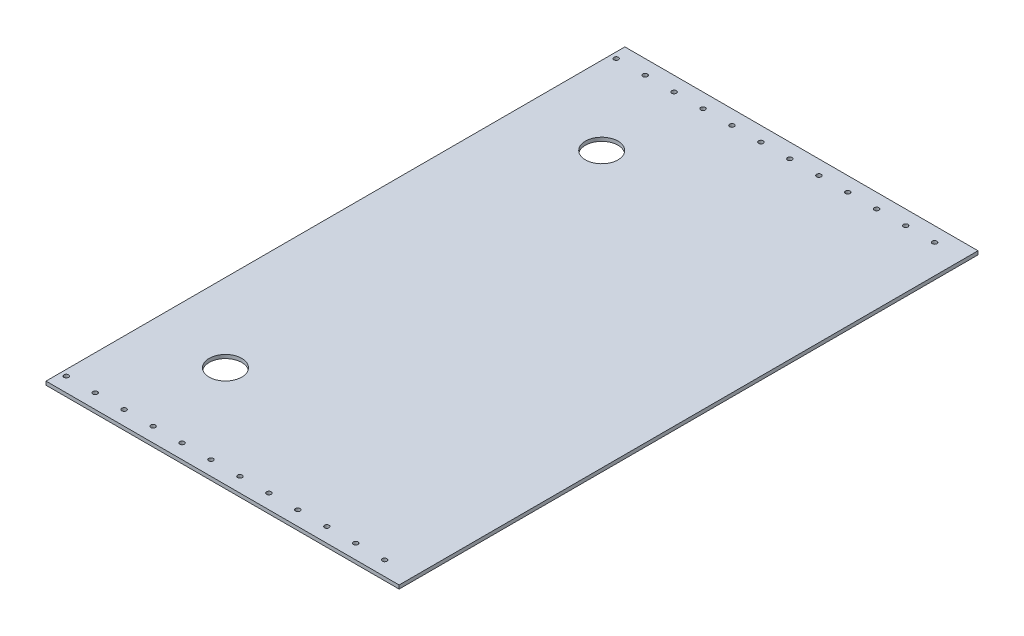
ISO-10303-21;
HEADER;
FILE_DESCRIPTION(('STEP AP214'),'2;1');
FILE_NAME('part.step','',(''),(''),'','','');
FILE_SCHEMA(('AUTOMOTIVE_DESIGN { 1 0 10303 214 1 1 1 1 }'));
ENDSEC;
DATA;
#1=APPLICATION_CONTEXT('core data for automotive mechanical design processes');
#2=APPLICATION_PROTOCOL_DEFINITION('international standard','automotive_design',2000,#1);
#3=PRODUCT_CONTEXT('',#1,'mechanical');
#4=PRODUCT('Part','Part','',(#3));
#5=PRODUCT_RELATED_PRODUCT_CATEGORY('part','',(#4));
#6=PRODUCT_DEFINITION_FORMATION('','',#4);
#7=PRODUCT_DEFINITION_CONTEXT('part definition',#1,'design');
#8=PRODUCT_DEFINITION('design','',#6,#7);
#9=PRODUCT_DEFINITION_SHAPE('','',#8);
#10=(LENGTH_UNIT() NAMED_UNIT(*) SI_UNIT(.MILLI.,.METRE.));
#11=(NAMED_UNIT(*) PLANE_ANGLE_UNIT() SI_UNIT($,.RADIAN.));
#12=(NAMED_UNIT(*) SI_UNIT($,.STERADIAN.) SOLID_ANGLE_UNIT());
#13=UNCERTAINTY_MEASURE_WITH_UNIT(LENGTH_MEASURE(1.E-05),#10,'distance_accuracy_value','');
#14=(GEOMETRIC_REPRESENTATION_CONTEXT(3) GLOBAL_UNCERTAINTY_ASSIGNED_CONTEXT((#13)) GLOBAL_UNIT_ASSIGNED_CONTEXT((#10,
#11,#12)) REPRESENTATION_CONTEXT('',''));
#15=CARTESIAN_POINT('',(0.,0.,0.));
#16=DIRECTION('',(0.,0.,1.));
#17=DIRECTION('',(1.,0.,0.));
#18=AXIS2_PLACEMENT_3D('',#15,#16,#17);
#19=CARTESIAN_POINT('',(0.,3.175,0.));
#20=DIRECTION('',(0.,0.,-1.));
#21=DIRECTION('',(-1.,0.,0.));
#22=AXIS2_PLACEMENT_3D('',#19,#20,#21);
#23=PLANE('',#22);
#24=DIRECTION('',(0.,1.,0.));
#25=VECTOR('',#24,1.);
#26=CARTESIAN_POINT('',(261.62,3.175,0.));
#27=LINE('',#26,#25);
#28=CARTESIAN_POINT('',(261.62,0.,0.));
#29=VERTEX_POINT('',#28);
#30=CARTESIAN_POINT('',(261.62,3.175,0.));
#31=VERTEX_POINT('',#30);
#32=EDGE_CURVE('E317',#29,#31,#27,.T.);
#33=ORIENTED_EDGE('',*,*,#32,.F.);
#34=DIRECTION('',(1.,0.,0.));
#35=VECTOR('',#34,1.);
#36=CARTESIAN_POINT('',(0.,0.,0.));
#37=LINE('',#36,#35);
#38=CARTESIAN_POINT('',(571.5,0.,0.));
#39=VERTEX_POINT('',#38);
#40=EDGE_CURVE('E85',#29,#39,#37,.T.);
#41=ORIENTED_EDGE('',*,*,#40,.T.);
#42=DIRECTION('',(0.,-1.,0.));
#43=VECTOR('',#42,1.);
#44=CARTESIAN_POINT('',(571.5,3.175,0.));
#45=LINE('',#44,#43);
#46=CARTESIAN_POINT('',(571.5,3.175,0.));
#47=VERTEX_POINT('',#46);
#48=EDGE_CURVE('E11',#47,#39,#45,.T.);
#49=ORIENTED_EDGE('',*,*,#48,.F.);
#50=DIRECTION('',(1.,0.,0.));
#51=VECTOR('',#50,1.);
#52=CARTESIAN_POINT('',(0.,3.175,0.));
#53=LINE('',#52,#51);
#54=EDGE_CURVE('E95',#31,#47,#53,.T.);
#55=ORIENTED_EDGE('',*,*,#54,.F.);
#56=EDGE_LOOP('',(#33,#41,#49,#55));
#57=FACE_BOUND('',#56,.T.);
#58=ADVANCED_FACE('F39',(#57),#23,.F.);
#59=CARTESIAN_POINT('',(0.,3.175,-508.));
#60=DIRECTION('',(0.,0.,1.));
#61=DIRECTION('',(1.,0.,0.));
#62=AXIS2_PLACEMENT_3D('',#59,#60,#61);
#63=PLANE('',#62);
#64=DIRECTION('',(0.,-1.,0.));
#65=VECTOR('',#64,1.);
#66=CARTESIAN_POINT('',(261.62,3.175,-508.));
#67=LINE('',#66,#65);
#68=CARTESIAN_POINT('',(261.62,3.175,-508.));
#69=VERTEX_POINT('',#68);
#70=CARTESIAN_POINT('',(261.62,0.,-508.));
#71=VERTEX_POINT('',#70);
#72=EDGE_CURVE('E54',#69,#71,#67,.T.);
#73=ORIENTED_EDGE('',*,*,#72,.F.);
#74=DIRECTION('',(-1.,0.,0.));
#75=VECTOR('',#74,1.);
#76=CARTESIAN_POINT('',(0.,3.175,-508.));
#77=LINE('',#76,#75);
#78=CARTESIAN_POINT('',(571.5,3.175,-508.));
#79=VERTEX_POINT('',#78);
#80=EDGE_CURVE('E90',#79,#69,#77,.T.);
#81=ORIENTED_EDGE('',*,*,#80,.F.);
#82=DIRECTION('',(0.,-1.,0.));
#83=VECTOR('',#82,1.);
#84=CARTESIAN_POINT('',(571.5,3.175,-508.));
#85=LINE('',#84,#83);
#86=CARTESIAN_POINT('',(571.5,0.,-508.));
#87=VERTEX_POINT('',#86);
#88=EDGE_CURVE('E47',#79,#87,#85,.T.);
#89=ORIENTED_EDGE('',*,*,#88,.T.);
#90=DIRECTION('',(-1.,0.,0.));
#91=VECTOR('',#90,1.);
#92=CARTESIAN_POINT('',(0.,0.,-508.));
#93=LINE('',#92,#91);
#94=EDGE_CURVE('E84',#87,#71,#93,.T.);
#95=ORIENTED_EDGE('',*,*,#94,.T.);
#96=EDGE_LOOP('',(#73,#81,#89,#95));
#97=FACE_BOUND('',#96,.T.);
#98=ADVANCED_FACE('F89',(#97),#63,.F.);
#99=CARTESIAN_POINT('',(0.,3.175,0.));
#100=DIRECTION('',(0.,-1.,0.));
#101=DIRECTION('',(0.,0.,-1.));
#102=AXIS2_PLACEMENT_3D('',#99,#100,#101);
#103=PLANE('',#102);
#104=CARTESIAN_POINT('',(342.9,3.175,-495.3));
#105=DIRECTION('',(0.,1.,0.));
#106=DIRECTION('',(0.,0.,1.));
#107=AXIS2_PLACEMENT_3D('',#104,#105,#106);
#108=CIRCLE('',#107,2.01929999999992);
#109=CARTESIAN_POINT('',(342.9,3.175,-493.2807));
#110=VERTEX_POINT('',#109);
#111=EDGE_CURVE('E212',#110,#110,#108,.T.);
#112=ORIENTED_EDGE('',*,*,#111,.F.);
#113=EDGE_LOOP('',(#112));
#114=FACE_BOUND('',#113,.T.);
#115=CARTESIAN_POINT('',(317.5,3.175,-495.3));
#116=DIRECTION('',(0.,1.,0.));
#117=DIRECTION('',(0.,0.,1.));
#118=AXIS2_PLACEMENT_3D('',#115,#116,#117);
#119=CIRCLE('',#118,2.01929999999992);
#120=CARTESIAN_POINT('',(317.5,3.175,-493.2807));
#121=VERTEX_POINT('',#120);
#122=EDGE_CURVE('E204',#121,#121,#119,.T.);
#123=ORIENTED_EDGE('',*,*,#122,.F.);
#124=EDGE_LOOP('',(#123));
#125=FACE_BOUND('',#124,.T.);
#126=CARTESIAN_POINT('',(292.1,3.175,-495.3));
#127=DIRECTION('',(0.,1.,0.));
#128=DIRECTION('',(0.,0.,1.));
#129=AXIS2_PLACEMENT_3D('',#126,#127,#128);
#130=CIRCLE('',#129,2.01929999999992);
#131=CARTESIAN_POINT('',(292.1,3.175,-493.2807));
#132=VERTEX_POINT('',#131);
#133=EDGE_CURVE('E196',#132,#132,#130,.T.);
#134=ORIENTED_EDGE('',*,*,#133,.F.);
#135=EDGE_LOOP('',(#134));
#136=FACE_BOUND('',#135,.T.);
#137=CARTESIAN_POINT('',(266.7,3.175,-495.3));
#138=DIRECTION('',(0.,1.,0.));
#139=DIRECTION('',(0.,0.,1.));
#140=AXIS2_PLACEMENT_3D('',#137,#138,#139);
#141=CIRCLE('',#140,2.01929999999992);
#142=CARTESIAN_POINT('',(266.7,3.175,-493.2807));
#143=VERTEX_POINT('',#142);
#144=EDGE_CURVE('E187',#143,#143,#141,.T.);
#145=ORIENTED_EDGE('',*,*,#144,.F.);
#146=EDGE_LOOP('',(#145));
#147=FACE_BOUND('',#146,.T.);
#148=CARTESIAN_POINT('',(266.7,3.175,-12.7));
#149=DIRECTION('',(0.,1.,0.));
#150=DIRECTION('',(0.,0.,-1.));
#151=AXIS2_PLACEMENT_3D('',#148,#149,#150);
#152=CIRCLE('',#151,2.01929999999992);
#153=CARTESIAN_POINT('',(266.7,3.175,-14.7192999999999));
#154=VERTEX_POINT('',#153);
#155=EDGE_CURVE('E219',#154,#154,#152,.T.);
#156=ORIENTED_EDGE('',*,*,#155,.F.);
#157=EDGE_LOOP('',(#156));
#158=FACE_BOUND('',#157,.T.);
#159=CARTESIAN_POINT('',(469.9,3.175,-495.3));
#160=DIRECTION('',(0.,1.,0.));
#161=DIRECTION('',(0.,0.,1.));
#162=AXIS2_PLACEMENT_3D('',#159,#160,#161);
#163=CIRCLE('',#162,2.01929999999992);
#164=CARTESIAN_POINT('',(469.9,3.175,-493.2807));
#165=VERTEX_POINT('',#164);
#166=EDGE_CURVE('E139',#165,#165,#163,.T.);
#167=ORIENTED_EDGE('',*,*,#166,.F.);
#168=EDGE_LOOP('',(#167));
#169=FACE_BOUND('',#168,.T.);
#170=CARTESIAN_POINT('',(495.3,3.175,-495.3));
#171=DIRECTION('',(0.,1.,0.));
#172=DIRECTION('',(0.,0.,1.));
#173=AXIS2_PLACEMENT_3D('',#170,#171,#172);
#174=CIRCLE('',#173,2.01929999999992);
#175=CARTESIAN_POINT('',(495.3,3.175,-493.2807));
#176=VERTEX_POINT('',#175);
#177=EDGE_CURVE('E148',#176,#176,#174,.T.);
#178=ORIENTED_EDGE('',*,*,#177,.F.);
#179=EDGE_LOOP('',(#178));
#180=FACE_BOUND('',#179,.T.);
#181=CARTESIAN_POINT('',(520.7,3.175,-495.3));
#182=DIRECTION('',(0.,1.,0.));
#183=DIRECTION('',(0.,0.,1.));
#184=AXIS2_PLACEMENT_3D('',#181,#182,#183);
#185=CIRCLE('',#184,2.01929999999992);
#186=CARTESIAN_POINT('',(520.7,3.175,-493.2807));
#187=VERTEX_POINT('',#186);
#188=EDGE_CURVE('E131',#187,#187,#185,.T.);
#189=ORIENTED_EDGE('',*,*,#188,.F.);
#190=EDGE_LOOP('',(#189));
#191=FACE_BOUND('',#190,.T.);
#192=CARTESIAN_POINT('',(444.5,3.175,-495.3));
#193=DIRECTION('',(0.,1.,0.));
#194=DIRECTION('',(0.,0.,1.));
#195=AXIS2_PLACEMENT_3D('',#192,#193,#194);
#196=CIRCLE('',#195,2.01929999999992);
#197=CARTESIAN_POINT('',(444.5,3.175,-493.2807));
#198=VERTEX_POINT('',#197);
#199=EDGE_CURVE('E180',#198,#198,#196,.T.);
#200=ORIENTED_EDGE('',*,*,#199,.F.);
#201=EDGE_LOOP('',(#200));
#202=FACE_BOUND('',#201,.T.);
#203=CARTESIAN_POINT('',(419.1,3.175,-495.3));
#204=DIRECTION('',(0.,1.,0.));
#205=DIRECTION('',(0.,0.,1.));
#206=AXIS2_PLACEMENT_3D('',#203,#204,#205);
#207=CIRCLE('',#206,2.01929999999992);
#208=CARTESIAN_POINT('',(419.1,3.175,-493.2807));
#209=VERTEX_POINT('',#208);
#210=EDGE_CURVE('E172',#209,#209,#207,.T.);
#211=ORIENTED_EDGE('',*,*,#210,.F.);
#212=EDGE_LOOP('',(#211));
#213=FACE_BOUND('',#212,.T.);
#214=CARTESIAN_POINT('',(393.7,3.175,-495.3));
#215=DIRECTION('',(0.,1.,0.));
#216=DIRECTION('',(0.,0.,1.));
#217=AXIS2_PLACEMENT_3D('',#214,#215,#216);
#218=CIRCLE('',#217,2.01929999999992);
#219=CARTESIAN_POINT('',(393.7,3.175,-493.2807));
#220=VERTEX_POINT('',#219);
#221=EDGE_CURVE('E164',#220,#220,#218,.T.);
#222=ORIENTED_EDGE('',*,*,#221,.F.);
#223=EDGE_LOOP('',(#222));
#224=FACE_BOUND('',#223,.T.);
#225=CARTESIAN_POINT('',(368.3,3.175,-495.3));
#226=DIRECTION('',(0.,1.,0.));
#227=DIRECTION('',(0.,0.,1.));
#228=AXIS2_PLACEMENT_3D('',#225,#226,#227);
#229=CIRCLE('',#228,2.01929999999992);
#230=CARTESIAN_POINT('',(368.3,3.175,-493.2807));
#231=VERTEX_POINT('',#230);
#232=EDGE_CURVE('E155',#231,#231,#229,.T.);
#233=ORIENTED_EDGE('',*,*,#232,.F.);
#234=EDGE_LOOP('',(#233));
#235=FACE_BOUND('',#234,.T.);
#236=CARTESIAN_POINT('',(292.1,3.175,-12.7));
#237=DIRECTION('',(0.,1.,0.));
#238=DIRECTION('',(0.,0.,-1.));
#239=AXIS2_PLACEMENT_3D('',#236,#237,#238);
#240=CIRCLE('',#239,2.01929999999992);
#241=CARTESIAN_POINT('',(292.1,3.175,-14.7192999999999));
#242=VERTEX_POINT('',#241);
#243=EDGE_CURVE('E308',#242,#242,#240,.T.);
#244=ORIENTED_EDGE('',*,*,#243,.F.);
#245=EDGE_LOOP('',(#244));
#246=FACE_BOUND('',#245,.T.);
#247=CARTESIAN_POINT('',(317.5,3.175,-12.7));
#248=DIRECTION('',(0.,1.,0.));
#249=DIRECTION('',(0.,0.,-1.));
#250=AXIS2_PLACEMENT_3D('',#247,#248,#249);
#251=CIRCLE('',#250,2.01929999999992);
#252=CARTESIAN_POINT('',(317.5,3.175,-14.7192999999999));
#253=VERTEX_POINT('',#252);
#254=EDGE_CURVE('E300',#253,#253,#251,.T.);
#255=ORIENTED_EDGE('',*,*,#254,.F.);
#256=EDGE_LOOP('',(#255));
#257=FACE_BOUND('',#256,.T.);
#258=CARTESIAN_POINT('',(342.9,3.175,-12.7));
#259=DIRECTION('',(0.,1.,0.));
#260=DIRECTION('',(0.,0.,-1.));
#261=AXIS2_PLACEMENT_3D('',#258,#259,#260);
#262=CIRCLE('',#261,2.01929999999992);
#263=CARTESIAN_POINT('',(342.9,3.175,-14.7192999999999));
#264=VERTEX_POINT('',#263);
#265=EDGE_CURVE('E292',#264,#264,#262,.T.);
#266=ORIENTED_EDGE('',*,*,#265,.F.);
#267=EDGE_LOOP('',(#266));
#268=FACE_BOUND('',#267,.T.);
#269=CARTESIAN_POINT('',(368.3,3.175,-12.7));
#270=DIRECTION('',(0.,1.,0.));
#271=DIRECTION('',(0.,0.,-1.));
#272=AXIS2_PLACEMENT_3D('',#269,#270,#271);
#273=CIRCLE('',#272,2.01929999999992);
#274=CARTESIAN_POINT('',(368.3,3.175,-14.7192999999999));
#275=VERTEX_POINT('',#274);
#276=EDGE_CURVE('E284',#275,#275,#273,.T.);
#277=ORIENTED_EDGE('',*,*,#276,.F.);
#278=EDGE_LOOP('',(#277));
#279=FACE_BOUND('',#278,.T.);
#280=CARTESIAN_POINT('',(393.7,3.175,-12.7));
#281=DIRECTION('',(0.,1.,0.));
#282=DIRECTION('',(0.,0.,-1.));
#283=AXIS2_PLACEMENT_3D('',#280,#281,#282);
#284=CIRCLE('',#283,2.01929999999992);
#285=CARTESIAN_POINT('',(393.7,3.175,-14.7192999999999));
#286=VERTEX_POINT('',#285);
#287=EDGE_CURVE('E276',#286,#286,#284,.T.);
#288=ORIENTED_EDGE('',*,*,#287,.F.);
#289=EDGE_LOOP('',(#288));
#290=FACE_BOUND('',#289,.T.);
#291=CARTESIAN_POINT('',(419.1,3.175,-12.7));
#292=DIRECTION('',(0.,1.,0.));
#293=DIRECTION('',(0.,0.,-1.));
#294=AXIS2_PLACEMENT_3D('',#291,#292,#293);
#295=CIRCLE('',#294,2.01929999999992);
#296=CARTESIAN_POINT('',(419.1,3.175,-14.7192999999999));
#297=VERTEX_POINT('',#296);
#298=EDGE_CURVE('E268',#297,#297,#295,.T.);
#299=ORIENTED_EDGE('',*,*,#298,.F.);
#300=EDGE_LOOP('',(#299));
#301=FACE_BOUND('',#300,.T.);
#302=CARTESIAN_POINT('',(444.5,3.175,-12.7));
#303=DIRECTION('',(0.,1.,0.));
#304=DIRECTION('',(0.,0.,-1.));
#305=AXIS2_PLACEMENT_3D('',#302,#303,#304);
#306=CIRCLE('',#305,2.01929999999992);
#307=CARTESIAN_POINT('',(444.5,3.175,-14.7192999999999));
#308=VERTEX_POINT('',#307);
#309=EDGE_CURVE('E260',#308,#308,#306,.T.);
#310=ORIENTED_EDGE('',*,*,#309,.F.);
#311=EDGE_LOOP('',(#310));
#312=FACE_BOUND('',#311,.T.);
#313=CARTESIAN_POINT('',(469.9,3.175,-12.7));
#314=DIRECTION('',(0.,1.,0.));
#315=DIRECTION('',(0.,0.,-1.));
#316=AXIS2_PLACEMENT_3D('',#313,#314,#315);
#317=CIRCLE('',#316,2.01929999999992);
#318=CARTESIAN_POINT('',(469.9,3.175,-14.7192999999999));
#319=VERTEX_POINT('',#318);
#320=EDGE_CURVE('E252',#319,#319,#317,.T.);
#321=ORIENTED_EDGE('',*,*,#320,.F.);
#322=EDGE_LOOP('',(#321));
#323=FACE_BOUND('',#322,.T.);
#324=CARTESIAN_POINT('',(495.3,3.175,-12.7));
#325=DIRECTION('',(0.,1.,0.));
#326=DIRECTION('',(0.,0.,-1.));
#327=AXIS2_PLACEMENT_3D('',#324,#325,#326);
#328=CIRCLE('',#327,2.01929999999992);
#329=CARTESIAN_POINT('',(495.3,3.175,-14.7192999999999));
#330=VERTEX_POINT('',#329);
#331=EDGE_CURVE('E244',#330,#330,#328,.T.);
#332=ORIENTED_EDGE('',*,*,#331,.F.);
#333=EDGE_LOOP('',(#332));
#334=FACE_BOUND('',#333,.T.);
#335=CARTESIAN_POINT('',(520.7,3.175,-12.7));
#336=DIRECTION('',(0.,1.,0.));
#337=DIRECTION('',(0.,0.,-1.));
#338=AXIS2_PLACEMENT_3D('',#335,#336,#337);
#339=CIRCLE('',#338,2.01929999999992);
#340=CARTESIAN_POINT('',(520.7,3.175,-14.7192999999999));
#341=VERTEX_POINT('',#340);
#342=EDGE_CURVE('E236',#341,#341,#339,.T.);
#343=ORIENTED_EDGE('',*,*,#342,.F.);
#344=EDGE_LOOP('',(#343));
#345=FACE_BOUND('',#344,.T.);
#346=CARTESIAN_POINT('',(546.1,3.175,-12.7));
#347=DIRECTION('',(0.,1.,0.));
#348=DIRECTION('',(0.,0.,-1.));
#349=AXIS2_PLACEMENT_3D('',#346,#347,#348);
#350=CIRCLE('',#349,2.01929999999992);
#351=CARTESIAN_POINT('',(546.1,3.175,-14.7192999999999));
#352=VERTEX_POINT('',#351);
#353=EDGE_CURVE('E227',#352,#352,#350,.T.);
#354=ORIENTED_EDGE('',*,*,#353,.F.);
#355=EDGE_LOOP('',(#354));
#356=FACE_BOUND('',#355,.T.);
#357=CARTESIAN_POINT('',(546.1,3.175,-495.3));
#358=DIRECTION('',(0.,1.,0.));
#359=DIRECTION('',(0.,0.,1.));
#360=AXIS2_PLACEMENT_3D('',#357,#358,#359);
#361=CIRCLE('',#360,2.01929999999992);
#362=CARTESIAN_POINT('',(546.1,3.175,-493.2807));
#363=VERTEX_POINT('',#362);
#364=EDGE_CURVE('E123',#363,#363,#361,.T.);
#365=ORIENTED_EDGE('',*,*,#364,.F.);
#366=EDGE_LOOP('',(#365));
#367=FACE_BOUND('',#366,.T.);
#368=CARTESIAN_POINT('',(330.2,3.175,-419.1));
#369=DIRECTION('',(0.,1.,0.));
#370=DIRECTION('',(0.,0.,1.));
#371=AXIS2_PLACEMENT_3D('',#368,#369,#370);
#372=CIRCLE('',#371,14.2875);
#373=CARTESIAN_POINT('',(330.2,3.175,-404.8125));
#374=VERTEX_POINT('',#373);
#375=EDGE_CURVE('E116',#374,#374,#372,.T.);
#376=ORIENTED_EDGE('',*,*,#375,.F.);
#377=EDGE_LOOP('',(#376));
#378=FACE_BOUND('',#377,.T.);
#379=CARTESIAN_POINT('',(330.2,3.175,-88.9));
#380=DIRECTION('',(0.,1.,0.));
#381=DIRECTION('',(0.,0.,1.));
#382=AXIS2_PLACEMENT_3D('',#379,#380,#381);
#383=CIRCLE('',#382,14.2875);
#384=CARTESIAN_POINT('',(330.2,3.175,-74.6125));
#385=VERTEX_POINT('',#384);
#386=EDGE_CURVE('E107',#385,#385,#383,.T.);
#387=ORIENTED_EDGE('',*,*,#386,.F.);
#388=EDGE_LOOP('',(#387));
#389=FACE_BOUND('',#388,.T.);
#390=DIRECTION('',(0.,0.,-1.));
#391=VECTOR('',#390,1.);
#392=CARTESIAN_POINT('',(261.62,3.175,-508.));
#393=LINE('',#392,#391);
#394=EDGE_CURVE('E232',#31,#69,#393,.T.);
#395=ORIENTED_EDGE('',*,*,#394,.F.);
#396=ORIENTED_EDGE('',*,*,#54,.T.);
#397=DIRECTION('',(0.,0.,-1.));
#398=VECTOR('',#397,1.);
#399=CARTESIAN_POINT('',(571.5,3.175,0.));
#400=LINE('',#399,#398);
#401=EDGE_CURVE('E63',#47,#79,#400,.T.);
#402=ORIENTED_EDGE('',*,*,#401,.T.);
#403=ORIENTED_EDGE('',*,*,#80,.T.);
#404=EDGE_LOOP('',(#395,#396,#402,#403));
#405=FACE_BOUND('',#404,.T.);
#406=ADVANCED_FACE('F333',(#114,#125,#136,#147,#158,#169,#180,#191,#202,#213,#224,#235,#246,
#257,#268,#279,#290,#301,#312,#323,#334,#345,#356,#367,#378,#389,#405),#103,.F.);
#407=CARTESIAN_POINT('',(0.,0.,0.));
#408=DIRECTION('',(0.,-1.,0.));
#409=DIRECTION('',(0.,0.,-1.));
#410=AXIS2_PLACEMENT_3D('',#407,#408,#409);
#411=PLANE('',#410);
#412=CARTESIAN_POINT('',(330.2,0.,-88.9));
#413=DIRECTION('',(0.,1.,0.));
#414=DIRECTION('',(0.,0.,1.));
#415=AXIS2_PLACEMENT_3D('',#412,#413,#414);
#416=CIRCLE('',#415,14.2875);
#417=CARTESIAN_POINT('',(330.2,0.,-74.6125));
#418=VERTEX_POINT('',#417);
#419=EDGE_CURVE('E111',#418,#418,#416,.T.);
#420=ORIENTED_EDGE('',*,*,#419,.T.);
#421=EDGE_LOOP('',(#420));
#422=FACE_BOUND('',#421,.T.);
#423=CARTESIAN_POINT('',(330.2,0.,-419.1));
#424=DIRECTION('',(0.,1.,0.));
#425=DIRECTION('',(0.,0.,1.));
#426=AXIS2_PLACEMENT_3D('',#423,#424,#425);
#427=CIRCLE('',#426,14.2875);
#428=CARTESIAN_POINT('',(330.2,0.,-404.8125));
#429=VERTEX_POINT('',#428);
#430=EDGE_CURVE('E102',#429,#429,#427,.T.);
#431=ORIENTED_EDGE('',*,*,#430,.T.);
#432=EDGE_LOOP('',(#431));
#433=FACE_BOUND('',#432,.T.);
#434=CARTESIAN_POINT('',(546.1,0.,-495.3));
#435=DIRECTION('',(0.,1.,0.));
#436=DIRECTION('',(0.,0.,1.));
#437=AXIS2_PLACEMENT_3D('',#434,#435,#436);
#438=CIRCLE('',#437,2.01929999999992);
#439=CARTESIAN_POINT('',(546.1,0.,-493.2807));
#440=VERTEX_POINT('',#439);
#441=EDGE_CURVE('E112',#440,#440,#438,.T.);
#442=ORIENTED_EDGE('',*,*,#441,.T.);
#443=EDGE_LOOP('',(#442));
#444=FACE_BOUND('',#443,.T.);
#445=CARTESIAN_POINT('',(546.1,0.,-12.7));
#446=DIRECTION('',(0.,1.,0.));
#447=DIRECTION('',(0.,0.,-1.));
#448=AXIS2_PLACEMENT_3D('',#445,#446,#447);
#449=CIRCLE('',#448,2.01929999999992);
#450=CARTESIAN_POINT('',(546.1,0.,-14.7192999999999));
#451=VERTEX_POINT('',#450);
#452=EDGE_CURVE('E231',#451,#451,#449,.T.);
#453=ORIENTED_EDGE('',*,*,#452,.T.);
#454=EDGE_LOOP('',(#453));
#455=FACE_BOUND('',#454,.T.);
#456=CARTESIAN_POINT('',(520.7,0.,-12.7));
#457=DIRECTION('',(0.,1.,0.));
#458=DIRECTION('',(0.,0.,-1.));
#459=AXIS2_PLACEMENT_3D('',#456,#457,#458);
#460=CIRCLE('',#459,2.01929999999992);
#461=CARTESIAN_POINT('',(520.7,0.,-14.7192999999999));
#462=VERTEX_POINT('',#461);
#463=EDGE_CURVE('E240',#462,#462,#460,.T.);
#464=ORIENTED_EDGE('',*,*,#463,.T.);
#465=EDGE_LOOP('',(#464));
#466=FACE_BOUND('',#465,.T.);
#467=CARTESIAN_POINT('',(495.3,0.,-12.7));
#468=DIRECTION('',(0.,1.,0.));
#469=DIRECTION('',(0.,0.,-1.));
#470=AXIS2_PLACEMENT_3D('',#467,#468,#469);
#471=CIRCLE('',#470,2.01929999999992);
#472=CARTESIAN_POINT('',(495.3,0.,-14.7192999999999));
#473=VERTEX_POINT('',#472);
#474=EDGE_CURVE('E248',#473,#473,#471,.T.);
#475=ORIENTED_EDGE('',*,*,#474,.T.);
#476=EDGE_LOOP('',(#475));
#477=FACE_BOUND('',#476,.T.);
#478=CARTESIAN_POINT('',(469.9,0.,-12.7));
#479=DIRECTION('',(0.,1.,0.));
#480=DIRECTION('',(0.,0.,-1.));
#481=AXIS2_PLACEMENT_3D('',#478,#479,#480);
#482=CIRCLE('',#481,2.01929999999992);
#483=CARTESIAN_POINT('',(469.9,0.,-14.7192999999999));
#484=VERTEX_POINT('',#483);
#485=EDGE_CURVE('E256',#484,#484,#482,.T.);
#486=ORIENTED_EDGE('',*,*,#485,.T.);
#487=EDGE_LOOP('',(#486));
#488=FACE_BOUND('',#487,.T.);
#489=CARTESIAN_POINT('',(444.5,0.,-12.7));
#490=DIRECTION('',(0.,1.,0.));
#491=DIRECTION('',(0.,0.,-1.));
#492=AXIS2_PLACEMENT_3D('',#489,#490,#491);
#493=CIRCLE('',#492,2.01929999999992);
#494=CARTESIAN_POINT('',(444.5,0.,-14.7192999999999));
#495=VERTEX_POINT('',#494);
#496=EDGE_CURVE('E264',#495,#495,#493,.T.);
#497=ORIENTED_EDGE('',*,*,#496,.T.);
#498=EDGE_LOOP('',(#497));
#499=FACE_BOUND('',#498,.T.);
#500=CARTESIAN_POINT('',(419.1,0.,-12.7));
#501=DIRECTION('',(0.,1.,0.));
#502=DIRECTION('',(0.,0.,-1.));
#503=AXIS2_PLACEMENT_3D('',#500,#501,#502);
#504=CIRCLE('',#503,2.01929999999992);
#505=CARTESIAN_POINT('',(419.1,0.,-14.7192999999999));
#506=VERTEX_POINT('',#505);
#507=EDGE_CURVE('E272',#506,#506,#504,.T.);
#508=ORIENTED_EDGE('',*,*,#507,.T.);
#509=EDGE_LOOP('',(#508));
#510=FACE_BOUND('',#509,.T.);
#511=CARTESIAN_POINT('',(393.7,0.,-12.7));
#512=DIRECTION('',(0.,1.,0.));
#513=DIRECTION('',(0.,0.,-1.));
#514=AXIS2_PLACEMENT_3D('',#511,#512,#513);
#515=CIRCLE('',#514,2.01929999999992);
#516=CARTESIAN_POINT('',(393.7,0.,-14.7192999999999));
#517=VERTEX_POINT('',#516);
#518=EDGE_CURVE('E280',#517,#517,#515,.T.);
#519=ORIENTED_EDGE('',*,*,#518,.T.);
#520=EDGE_LOOP('',(#519));
#521=FACE_BOUND('',#520,.T.);
#522=CARTESIAN_POINT('',(368.3,0.,-12.7));
#523=DIRECTION('',(0.,1.,0.));
#524=DIRECTION('',(0.,0.,-1.));
#525=AXIS2_PLACEMENT_3D('',#522,#523,#524);
#526=CIRCLE('',#525,2.01929999999992);
#527=CARTESIAN_POINT('',(368.3,0.,-14.7192999999999));
#528=VERTEX_POINT('',#527);
#529=EDGE_CURVE('E288',#528,#528,#526,.T.);
#530=ORIENTED_EDGE('',*,*,#529,.T.);
#531=EDGE_LOOP('',(#530));
#532=FACE_BOUND('',#531,.T.);
#533=CARTESIAN_POINT('',(342.9,0.,-12.7));
#534=DIRECTION('',(0.,1.,0.));
#535=DIRECTION('',(0.,0.,-1.));
#536=AXIS2_PLACEMENT_3D('',#533,#534,#535);
#537=CIRCLE('',#536,2.01929999999992);
#538=CARTESIAN_POINT('',(342.9,0.,-14.7192999999999));
#539=VERTEX_POINT('',#538);
#540=EDGE_CURVE('E296',#539,#539,#537,.T.);
#541=ORIENTED_EDGE('',*,*,#540,.T.);
#542=EDGE_LOOP('',(#541));
#543=FACE_BOUND('',#542,.T.);
#544=CARTESIAN_POINT('',(317.5,0.,-12.7));
#545=DIRECTION('',(0.,1.,0.));
#546=DIRECTION('',(0.,0.,-1.));
#547=AXIS2_PLACEMENT_3D('',#544,#545,#546);
#548=CIRCLE('',#547,2.01929999999992);
#549=CARTESIAN_POINT('',(317.5,0.,-14.7192999999999));
#550=VERTEX_POINT('',#549);
#551=EDGE_CURVE('E304',#550,#550,#548,.T.);
#552=ORIENTED_EDGE('',*,*,#551,.T.);
#553=EDGE_LOOP('',(#552));
#554=FACE_BOUND('',#553,.T.);
#555=CARTESIAN_POINT('',(292.1,0.,-12.7));
#556=DIRECTION('',(0.,1.,0.));
#557=DIRECTION('',(0.,0.,-1.));
#558=AXIS2_PLACEMENT_3D('',#555,#556,#557);
#559=CIRCLE('',#558,2.01929999999992);
#560=CARTESIAN_POINT('',(292.1,0.,-14.7192999999999));
#561=VERTEX_POINT('',#560);
#562=EDGE_CURVE('E223',#561,#561,#559,.T.);
#563=ORIENTED_EDGE('',*,*,#562,.T.);
#564=EDGE_LOOP('',(#563));
#565=FACE_BOUND('',#564,.T.);
#566=CARTESIAN_POINT('',(368.3,0.,-495.3));
#567=DIRECTION('',(0.,1.,0.));
#568=DIRECTION('',(0.,0.,1.));
#569=AXIS2_PLACEMENT_3D('',#566,#567,#568);
#570=CIRCLE('',#569,2.01929999999992);
#571=CARTESIAN_POINT('',(368.3,0.,-493.2807));
#572=VERTEX_POINT('',#571);
#573=EDGE_CURVE('E159',#572,#572,#570,.T.);
#574=ORIENTED_EDGE('',*,*,#573,.T.);
#575=EDGE_LOOP('',(#574));
#576=FACE_BOUND('',#575,.T.);
#577=CARTESIAN_POINT('',(393.7,0.,-495.3));
#578=DIRECTION('',(0.,1.,0.));
#579=DIRECTION('',(0.,0.,1.));
#580=AXIS2_PLACEMENT_3D('',#577,#578,#579);
#581=CIRCLE('',#580,2.01929999999992);
#582=CARTESIAN_POINT('',(393.7,0.,-493.2807));
#583=VERTEX_POINT('',#582);
#584=EDGE_CURVE('E168',#583,#583,#581,.T.);
#585=ORIENTED_EDGE('',*,*,#584,.T.);
#586=EDGE_LOOP('',(#585));
#587=FACE_BOUND('',#586,.T.);
#588=CARTESIAN_POINT('',(419.1,0.,-495.3));
#589=DIRECTION('',(0.,1.,0.));
#590=DIRECTION('',(0.,0.,1.));
#591=AXIS2_PLACEMENT_3D('',#588,#589,#590);
#592=CIRCLE('',#591,2.01929999999992);
#593=CARTESIAN_POINT('',(419.1,0.,-493.2807));
#594=VERTEX_POINT('',#593);
#595=EDGE_CURVE('E176',#594,#594,#592,.T.);
#596=ORIENTED_EDGE('',*,*,#595,.T.);
#597=EDGE_LOOP('',(#596));
#598=FACE_BOUND('',#597,.T.);
#599=CARTESIAN_POINT('',(444.5,0.,-495.3));
#600=DIRECTION('',(0.,1.,0.));
#601=DIRECTION('',(0.,0.,1.));
#602=AXIS2_PLACEMENT_3D('',#599,#600,#601);
#603=CIRCLE('',#602,2.01929999999992);
#604=CARTESIAN_POINT('',(444.5,0.,-493.2807));
#605=VERTEX_POINT('',#604);
#606=EDGE_CURVE('E144',#605,#605,#603,.T.);
#607=ORIENTED_EDGE('',*,*,#606,.T.);
#608=EDGE_LOOP('',(#607));
#609=FACE_BOUND('',#608,.T.);
#610=CARTESIAN_POINT('',(520.7,0.,-495.3));
#611=DIRECTION('',(0.,1.,0.));
#612=DIRECTION('',(0.,0.,1.));
#613=AXIS2_PLACEMENT_3D('',#610,#611,#612);
#614=CIRCLE('',#613,2.01929999999992);
#615=CARTESIAN_POINT('',(520.7,0.,-493.2807));
#616=VERTEX_POINT('',#615);
#617=EDGE_CURVE('E127',#616,#616,#614,.T.);
#618=ORIENTED_EDGE('',*,*,#617,.T.);
#619=EDGE_LOOP('',(#618));
#620=FACE_BOUND('',#619,.T.);
#621=CARTESIAN_POINT('',(495.3,0.,-495.3));
#622=DIRECTION('',(0.,1.,0.));
#623=DIRECTION('',(0.,0.,1.));
#624=AXIS2_PLACEMENT_3D('',#621,#622,#623);
#625=CIRCLE('',#624,2.01929999999992);
#626=CARTESIAN_POINT('',(495.3,0.,-493.2807));
#627=VERTEX_POINT('',#626);
#628=EDGE_CURVE('E135',#627,#627,#625,.T.);
#629=ORIENTED_EDGE('',*,*,#628,.T.);
#630=EDGE_LOOP('',(#629));
#631=FACE_BOUND('',#630,.T.);
#632=CARTESIAN_POINT('',(469.9,0.,-495.3));
#633=DIRECTION('',(0.,1.,0.));
#634=DIRECTION('',(0.,0.,1.));
#635=AXIS2_PLACEMENT_3D('',#632,#633,#634);
#636=CIRCLE('',#635,2.01929999999992);
#637=CARTESIAN_POINT('',(469.9,0.,-493.2807));
#638=VERTEX_POINT('',#637);
#639=EDGE_CURVE('E143',#638,#638,#636,.T.);
#640=ORIENTED_EDGE('',*,*,#639,.T.);
#641=EDGE_LOOP('',(#640));
#642=FACE_BOUND('',#641,.T.);
#643=CARTESIAN_POINT('',(266.7,0.,-12.7));
#644=DIRECTION('',(0.,1.,0.));
#645=DIRECTION('',(0.,0.,-1.));
#646=AXIS2_PLACEMENT_3D('',#643,#644,#645);
#647=CIRCLE('',#646,2.01929999999992);
#648=CARTESIAN_POINT('',(266.7,0.,-14.7192999999999));
#649=VERTEX_POINT('',#648);
#650=EDGE_CURVE('E192',#649,#649,#647,.T.);
#651=ORIENTED_EDGE('',*,*,#650,.T.);
#652=EDGE_LOOP('',(#651));
#653=FACE_BOUND('',#652,.T.);
#654=CARTESIAN_POINT('',(266.7,0.,-495.3));
#655=DIRECTION('',(0.,1.,0.));
#656=DIRECTION('',(0.,0.,1.));
#657=AXIS2_PLACEMENT_3D('',#654,#655,#656);
#658=CIRCLE('',#657,2.01929999999992);
#659=CARTESIAN_POINT('',(266.7,0.,-493.2807));
#660=VERTEX_POINT('',#659);
#661=EDGE_CURVE('E191',#660,#660,#658,.T.);
#662=ORIENTED_EDGE('',*,*,#661,.T.);
#663=EDGE_LOOP('',(#662));
#664=FACE_BOUND('',#663,.T.);
#665=CARTESIAN_POINT('',(292.1,0.,-495.3));
#666=DIRECTION('',(0.,1.,0.));
#667=DIRECTION('',(0.,0.,1.));
#668=AXIS2_PLACEMENT_3D('',#665,#666,#667);
#669=CIRCLE('',#668,2.01929999999992);
#670=CARTESIAN_POINT('',(292.1,0.,-493.2807));
#671=VERTEX_POINT('',#670);
#672=EDGE_CURVE('E200',#671,#671,#669,.T.);
#673=ORIENTED_EDGE('',*,*,#672,.T.);
#674=EDGE_LOOP('',(#673));
#675=FACE_BOUND('',#674,.T.);
#676=CARTESIAN_POINT('',(317.5,0.,-495.3));
#677=DIRECTION('',(0.,1.,0.));
#678=DIRECTION('',(0.,0.,1.));
#679=AXIS2_PLACEMENT_3D('',#676,#677,#678);
#680=CIRCLE('',#679,2.01929999999992);
#681=CARTESIAN_POINT('',(317.5,0.,-493.2807));
#682=VERTEX_POINT('',#681);
#683=EDGE_CURVE('E208',#682,#682,#680,.T.);
#684=ORIENTED_EDGE('',*,*,#683,.T.);
#685=EDGE_LOOP('',(#684));
#686=FACE_BOUND('',#685,.T.);
#687=CARTESIAN_POINT('',(342.9,0.,-495.3));
#688=DIRECTION('',(0.,1.,0.));
#689=DIRECTION('',(0.,0.,1.));
#690=AXIS2_PLACEMENT_3D('',#687,#688,#689);
#691=CIRCLE('',#690,2.01929999999992);
#692=CARTESIAN_POINT('',(342.9,0.,-493.2807));
#693=VERTEX_POINT('',#692);
#694=EDGE_CURVE('E160',#693,#693,#691,.T.);
#695=ORIENTED_EDGE('',*,*,#694,.T.);
#696=EDGE_LOOP('',(#695));
#697=FACE_BOUND('',#696,.T.);
#698=ORIENTED_EDGE('',*,*,#40,.F.);
#699=DIRECTION('',(0.,0.,1.));
#700=VECTOR('',#699,1.);
#701=CARTESIAN_POINT('',(261.62,0.,-508.));
#702=LINE('',#701,#700);
#703=EDGE_CURVE('E93',#71,#29,#702,.T.);
#704=ORIENTED_EDGE('',*,*,#703,.F.);
#705=ORIENTED_EDGE('',*,*,#94,.F.);
#706=DIRECTION('',(0.,0.,-1.));
#707=VECTOR('',#706,1.);
#708=CARTESIAN_POINT('',(571.5,0.,0.));
#709=LINE('',#708,#707);
#710=EDGE_CURVE('E75',#39,#87,#709,.T.);
#711=ORIENTED_EDGE('',*,*,#710,.F.);
#712=EDGE_LOOP('',(#698,#704,#705,#711));
#713=FACE_BOUND('',#712,.T.);
#714=ADVANCED_FACE('F92',(#422,#433,#444,#455,#466,#477,#488,#499,#510,#521,#532,#543,#554,#565,
#576,#587,#598,#609,#620,#631,#642,#653,#664,#675,#686,#697,#713),#411,.T.);
#715=CARTESIAN_POINT('',(571.5,3.175,0.));
#716=DIRECTION('',(-1.,0.,0.));
#717=DIRECTION('',(0.,0.,1.));
#718=AXIS2_PLACEMENT_3D('',#715,#716,#717);
#719=PLANE('',#718);
#720=ORIENTED_EDGE('',*,*,#710,.T.);
#721=ORIENTED_EDGE('',*,*,#88,.F.);
#722=ORIENTED_EDGE('',*,*,#401,.F.);
#723=ORIENTED_EDGE('',*,*,#48,.T.);
#724=EDGE_LOOP('',(#720,#721,#722,#723));
#725=FACE_BOUND('',#724,.T.);
#726=ADVANCED_FACE('F77',(#725),#719,.F.);
#727=CARTESIAN_POINT('',(330.2,0.,-88.9));
#728=DIRECTION('',(0.,1.,0.));
#729=DIRECTION('',(0.,0.,1.));
#730=AXIS2_PLACEMENT_3D('',#727,#728,#729);
#731=CYLINDRICAL_SURFACE('',#730,14.2875);
#732=ORIENTED_EDGE('',*,*,#419,.F.);
#733=EDGE_LOOP('',(#732));
#734=FACE_BOUND('',#733,.T.);
#735=ORIENTED_EDGE('',*,*,#386,.T.);
#736=EDGE_LOOP('',(#735));
#737=FACE_BOUND('',#736,.T.);
#738=ADVANCED_FACE('F594',(#734,#737),#731,.F.);
#739=CARTESIAN_POINT('',(330.2,0.,-419.1));
#740=DIRECTION('',(0.,1.,0.));
#741=DIRECTION('',(0.,0.,1.));
#742=AXIS2_PLACEMENT_3D('',#739,#740,#741);
#743=CYLINDRICAL_SURFACE('',#742,14.2875);
#744=ORIENTED_EDGE('',*,*,#430,.F.);
#745=EDGE_LOOP('',(#744));
#746=FACE_BOUND('',#745,.T.);
#747=ORIENTED_EDGE('',*,*,#375,.T.);
#748=EDGE_LOOP('',(#747));
#749=FACE_BOUND('',#748,.T.);
#750=ADVANCED_FACE('F585',(#746,#749),#743,.F.);
#751=CARTESIAN_POINT('',(546.1,0.,-495.3));
#752=DIRECTION('',(0.,1.,0.));
#753=DIRECTION('',(0.,0.,1.));
#754=AXIS2_PLACEMENT_3D('',#751,#752,#753);
#755=CYLINDRICAL_SURFACE('',#754,2.01929999999992);
#756=ORIENTED_EDGE('',*,*,#441,.F.);
#757=EDGE_LOOP('',(#756));
#758=FACE_BOUND('',#757,.T.);
#759=ORIENTED_EDGE('',*,*,#364,.T.);
#760=EDGE_LOOP('',(#759));
#761=FACE_BOUND('',#760,.T.);
#762=ADVANCED_FACE('F576',(#758,#761),#755,.F.);
#763=CARTESIAN_POINT('',(546.1,0.,-12.7));
#764=DIRECTION('',(0.,1.,0.));
#765=DIRECTION('',(0.,0.,1.));
#766=AXIS2_PLACEMENT_3D('',#763,#764,#765);
#767=CYLINDRICAL_SURFACE('',#766,2.01929999999992);
#768=ORIENTED_EDGE('',*,*,#452,.F.);
#769=EDGE_LOOP('',(#768));
#770=FACE_BOUND('',#769,.T.);
#771=ORIENTED_EDGE('',*,*,#353,.T.);
#772=EDGE_LOOP('',(#771));
#773=FACE_BOUND('',#772,.T.);
#774=ADVANCED_FACE('F567',(#770,#773),#767,.F.);
#775=CARTESIAN_POINT('',(520.7,0.,-12.7));
#776=DIRECTION('',(0.,1.,0.));
#777=DIRECTION('',(0.,0.,1.));
#778=AXIS2_PLACEMENT_3D('',#775,#776,#777);
#779=CYLINDRICAL_SURFACE('',#778,2.01929999999992);
#780=ORIENTED_EDGE('',*,*,#463,.F.);
#781=EDGE_LOOP('',(#780));
#782=FACE_BOUND('',#781,.T.);
#783=ORIENTED_EDGE('',*,*,#342,.T.);
#784=EDGE_LOOP('',(#783));
#785=FACE_BOUND('',#784,.T.);
#786=ADVANCED_FACE('F558',(#782,#785),#779,.F.);
#787=CARTESIAN_POINT('',(495.3,0.,-12.7));
#788=DIRECTION('',(0.,1.,0.));
#789=DIRECTION('',(0.,0.,1.));
#790=AXIS2_PLACEMENT_3D('',#787,#788,#789);
#791=CYLINDRICAL_SURFACE('',#790,2.01929999999992);
#792=ORIENTED_EDGE('',*,*,#474,.F.);
#793=EDGE_LOOP('',(#792));
#794=FACE_BOUND('',#793,.T.);
#795=ORIENTED_EDGE('',*,*,#331,.T.);
#796=EDGE_LOOP('',(#795));
#797=FACE_BOUND('',#796,.T.);
#798=ADVANCED_FACE('F549',(#794,#797),#791,.F.);
#799=CARTESIAN_POINT('',(469.9,0.,-12.7));
#800=DIRECTION('',(0.,1.,0.));
#801=DIRECTION('',(0.,0.,1.));
#802=AXIS2_PLACEMENT_3D('',#799,#800,#801);
#803=CYLINDRICAL_SURFACE('',#802,2.01929999999992);
#804=ORIENTED_EDGE('',*,*,#485,.F.);
#805=EDGE_LOOP('',(#804));
#806=FACE_BOUND('',#805,.T.);
#807=ORIENTED_EDGE('',*,*,#320,.T.);
#808=EDGE_LOOP('',(#807));
#809=FACE_BOUND('',#808,.T.);
#810=ADVANCED_FACE('F540',(#806,#809),#803,.F.);
#811=CARTESIAN_POINT('',(444.5,0.,-12.7));
#812=DIRECTION('',(0.,1.,0.));
#813=DIRECTION('',(0.,0.,1.));
#814=AXIS2_PLACEMENT_3D('',#811,#812,#813);
#815=CYLINDRICAL_SURFACE('',#814,2.01929999999992);
#816=ORIENTED_EDGE('',*,*,#496,.F.);
#817=EDGE_LOOP('',(#816));
#818=FACE_BOUND('',#817,.T.);
#819=ORIENTED_EDGE('',*,*,#309,.T.);
#820=EDGE_LOOP('',(#819));
#821=FACE_BOUND('',#820,.T.);
#822=ADVANCED_FACE('F531',(#818,#821),#815,.F.);
#823=CARTESIAN_POINT('',(419.1,0.,-12.7));
#824=DIRECTION('',(0.,1.,0.));
#825=DIRECTION('',(0.,0.,1.));
#826=AXIS2_PLACEMENT_3D('',#823,#824,#825);
#827=CYLINDRICAL_SURFACE('',#826,2.01929999999992);
#828=ORIENTED_EDGE('',*,*,#507,.F.);
#829=EDGE_LOOP('',(#828));
#830=FACE_BOUND('',#829,.T.);
#831=ORIENTED_EDGE('',*,*,#298,.T.);
#832=EDGE_LOOP('',(#831));
#833=FACE_BOUND('',#832,.T.);
#834=ADVANCED_FACE('F522',(#830,#833),#827,.F.);
#835=CARTESIAN_POINT('',(393.7,0.,-12.7));
#836=DIRECTION('',(0.,1.,0.));
#837=DIRECTION('',(0.,0.,1.));
#838=AXIS2_PLACEMENT_3D('',#835,#836,#837);
#839=CYLINDRICAL_SURFACE('',#838,2.01929999999992);
#840=ORIENTED_EDGE('',*,*,#518,.F.);
#841=EDGE_LOOP('',(#840));
#842=FACE_BOUND('',#841,.T.);
#843=ORIENTED_EDGE('',*,*,#287,.T.);
#844=EDGE_LOOP('',(#843));
#845=FACE_BOUND('',#844,.T.);
#846=ADVANCED_FACE('F513',(#842,#845),#839,.F.);
#847=CARTESIAN_POINT('',(368.3,0.,-12.7));
#848=DIRECTION('',(0.,1.,0.));
#849=DIRECTION('',(0.,0.,1.));
#850=AXIS2_PLACEMENT_3D('',#847,#848,#849);
#851=CYLINDRICAL_SURFACE('',#850,2.01929999999992);
#852=ORIENTED_EDGE('',*,*,#529,.F.);
#853=EDGE_LOOP('',(#852));
#854=FACE_BOUND('',#853,.T.);
#855=ORIENTED_EDGE('',*,*,#276,.T.);
#856=EDGE_LOOP('',(#855));
#857=FACE_BOUND('',#856,.T.);
#858=ADVANCED_FACE('F504',(#854,#857),#851,.F.);
#859=CARTESIAN_POINT('',(342.9,0.,-12.7));
#860=DIRECTION('',(0.,1.,0.));
#861=DIRECTION('',(0.,0.,1.));
#862=AXIS2_PLACEMENT_3D('',#859,#860,#861);
#863=CYLINDRICAL_SURFACE('',#862,2.01929999999992);
#864=ORIENTED_EDGE('',*,*,#540,.F.);
#865=EDGE_LOOP('',(#864));
#866=FACE_BOUND('',#865,.T.);
#867=ORIENTED_EDGE('',*,*,#265,.T.);
#868=EDGE_LOOP('',(#867));
#869=FACE_BOUND('',#868,.T.);
#870=ADVANCED_FACE('F495',(#866,#869),#863,.F.);
#871=CARTESIAN_POINT('',(317.5,0.,-12.7));
#872=DIRECTION('',(0.,1.,0.));
#873=DIRECTION('',(0.,0.,1.));
#874=AXIS2_PLACEMENT_3D('',#871,#872,#873);
#875=CYLINDRICAL_SURFACE('',#874,2.01929999999992);
#876=ORIENTED_EDGE('',*,*,#551,.F.);
#877=EDGE_LOOP('',(#876));
#878=FACE_BOUND('',#877,.T.);
#879=ORIENTED_EDGE('',*,*,#254,.T.);
#880=EDGE_LOOP('',(#879));
#881=FACE_BOUND('',#880,.T.);
#882=ADVANCED_FACE('F486',(#878,#881),#875,.F.);
#883=CARTESIAN_POINT('',(292.1,0.,-12.7));
#884=DIRECTION('',(0.,1.,0.));
#885=DIRECTION('',(0.,0.,1.));
#886=AXIS2_PLACEMENT_3D('',#883,#884,#885);
#887=CYLINDRICAL_SURFACE('',#886,2.01929999999992);
#888=ORIENTED_EDGE('',*,*,#562,.F.);
#889=EDGE_LOOP('',(#888));
#890=FACE_BOUND('',#889,.T.);
#891=ORIENTED_EDGE('',*,*,#243,.T.);
#892=EDGE_LOOP('',(#891));
#893=FACE_BOUND('',#892,.T.);
#894=ADVANCED_FACE('F477',(#890,#893),#887,.F.);
#895=CARTESIAN_POINT('',(368.3,0.,-495.3));
#896=DIRECTION('',(0.,1.,0.));
#897=DIRECTION('',(0.,0.,1.));
#898=AXIS2_PLACEMENT_3D('',#895,#896,#897);
#899=CYLINDRICAL_SURFACE('',#898,2.01929999999992);
#900=ORIENTED_EDGE('',*,*,#573,.F.);
#901=EDGE_LOOP('',(#900));
#902=FACE_BOUND('',#901,.T.);
#903=ORIENTED_EDGE('',*,*,#232,.T.);
#904=EDGE_LOOP('',(#903));
#905=FACE_BOUND('',#904,.T.);
#906=ADVANCED_FACE('F468',(#902,#905),#899,.F.);
#907=CARTESIAN_POINT('',(393.7,0.,-495.3));
#908=DIRECTION('',(0.,1.,0.));
#909=DIRECTION('',(0.,0.,1.));
#910=AXIS2_PLACEMENT_3D('',#907,#908,#909);
#911=CYLINDRICAL_SURFACE('',#910,2.01929999999992);
#912=ORIENTED_EDGE('',*,*,#584,.F.);
#913=EDGE_LOOP('',(#912));
#914=FACE_BOUND('',#913,.T.);
#915=ORIENTED_EDGE('',*,*,#221,.T.);
#916=EDGE_LOOP('',(#915));
#917=FACE_BOUND('',#916,.T.);
#918=ADVANCED_FACE('F459',(#914,#917),#911,.F.);
#919=CARTESIAN_POINT('',(419.1,0.,-495.3));
#920=DIRECTION('',(0.,1.,0.));
#921=DIRECTION('',(0.,0.,1.));
#922=AXIS2_PLACEMENT_3D('',#919,#920,#921);
#923=CYLINDRICAL_SURFACE('',#922,2.01929999999992);
#924=ORIENTED_EDGE('',*,*,#595,.F.);
#925=EDGE_LOOP('',(#924));
#926=FACE_BOUND('',#925,.T.);
#927=ORIENTED_EDGE('',*,*,#210,.T.);
#928=EDGE_LOOP('',(#927));
#929=FACE_BOUND('',#928,.T.);
#930=ADVANCED_FACE('F450',(#926,#929),#923,.F.);
#931=CARTESIAN_POINT('',(444.5,0.,-495.3));
#932=DIRECTION('',(0.,1.,0.));
#933=DIRECTION('',(0.,0.,1.));
#934=AXIS2_PLACEMENT_3D('',#931,#932,#933);
#935=CYLINDRICAL_SURFACE('',#934,2.01929999999992);
#936=ORIENTED_EDGE('',*,*,#606,.F.);
#937=EDGE_LOOP('',(#936));
#938=FACE_BOUND('',#937,.T.);
#939=ORIENTED_EDGE('',*,*,#199,.T.);
#940=EDGE_LOOP('',(#939));
#941=FACE_BOUND('',#940,.T.);
#942=ADVANCED_FACE('F441',(#938,#941),#935,.F.);
#943=CARTESIAN_POINT('',(520.7,0.,-495.3));
#944=DIRECTION('',(0.,1.,0.));
#945=DIRECTION('',(0.,0.,1.));
#946=AXIS2_PLACEMENT_3D('',#943,#944,#945);
#947=CYLINDRICAL_SURFACE('',#946,2.01929999999992);
#948=ORIENTED_EDGE('',*,*,#617,.F.);
#949=EDGE_LOOP('',(#948));
#950=FACE_BOUND('',#949,.T.);
#951=ORIENTED_EDGE('',*,*,#188,.T.);
#952=EDGE_LOOP('',(#951));
#953=FACE_BOUND('',#952,.T.);
#954=ADVANCED_FACE('F432',(#950,#953),#947,.F.);
#955=CARTESIAN_POINT('',(495.3,0.,-495.3));
#956=DIRECTION('',(0.,1.,0.));
#957=DIRECTION('',(0.,0.,1.));
#958=AXIS2_PLACEMENT_3D('',#955,#956,#957);
#959=CYLINDRICAL_SURFACE('',#958,2.01929999999992);
#960=ORIENTED_EDGE('',*,*,#628,.F.);
#961=EDGE_LOOP('',(#960));
#962=FACE_BOUND('',#961,.T.);
#963=ORIENTED_EDGE('',*,*,#177,.T.);
#964=EDGE_LOOP('',(#963));
#965=FACE_BOUND('',#964,.T.);
#966=ADVANCED_FACE('F423',(#962,#965),#959,.F.);
#967=CARTESIAN_POINT('',(469.9,0.,-495.3));
#968=DIRECTION('',(0.,1.,0.));
#969=DIRECTION('',(0.,0.,1.));
#970=AXIS2_PLACEMENT_3D('',#967,#968,#969);
#971=CYLINDRICAL_SURFACE('',#970,2.01929999999992);
#972=ORIENTED_EDGE('',*,*,#639,.F.);
#973=EDGE_LOOP('',(#972));
#974=FACE_BOUND('',#973,.T.);
#975=ORIENTED_EDGE('',*,*,#166,.T.);
#976=EDGE_LOOP('',(#975));
#977=FACE_BOUND('',#976,.T.);
#978=ADVANCED_FACE('F414',(#974,#977),#971,.F.);
#979=CARTESIAN_POINT('',(266.7,0.,-12.7));
#980=DIRECTION('',(0.,1.,0.));
#981=DIRECTION('',(0.,0.,1.));
#982=AXIS2_PLACEMENT_3D('',#979,#980,#981);
#983=CYLINDRICAL_SURFACE('',#982,2.01929999999992);
#984=ORIENTED_EDGE('',*,*,#650,.F.);
#985=EDGE_LOOP('',(#984));
#986=FACE_BOUND('',#985,.T.);
#987=ORIENTED_EDGE('',*,*,#155,.T.);
#988=EDGE_LOOP('',(#987));
#989=FACE_BOUND('',#988,.T.);
#990=ADVANCED_FACE('F405',(#986,#989),#983,.F.);
#991=CARTESIAN_POINT('',(266.7,0.,-495.3));
#992=DIRECTION('',(0.,1.,0.));
#993=DIRECTION('',(0.,0.,1.));
#994=AXIS2_PLACEMENT_3D('',#991,#992,#993);
#995=CYLINDRICAL_SURFACE('',#994,2.01929999999992);
#996=ORIENTED_EDGE('',*,*,#661,.F.);
#997=EDGE_LOOP('',(#996));
#998=FACE_BOUND('',#997,.T.);
#999=ORIENTED_EDGE('',*,*,#144,.T.);
#1000=EDGE_LOOP('',(#999));
#1001=FACE_BOUND('',#1000,.T.);
#1002=ADVANCED_FACE('F396',(#998,#1001),#995,.F.);
#1003=CARTESIAN_POINT('',(292.1,0.,-495.3));
#1004=DIRECTION('',(0.,1.,0.));
#1005=DIRECTION('',(0.,0.,1.));
#1006=AXIS2_PLACEMENT_3D('',#1003,#1004,#1005);
#1007=CYLINDRICAL_SURFACE('',#1006,2.01929999999992);
#1008=ORIENTED_EDGE('',*,*,#672,.F.);
#1009=EDGE_LOOP('',(#1008));
#1010=FACE_BOUND('',#1009,.T.);
#1011=ORIENTED_EDGE('',*,*,#133,.T.);
#1012=EDGE_LOOP('',(#1011));
#1013=FACE_BOUND('',#1012,.T.);
#1014=ADVANCED_FACE('F387',(#1010,#1013),#1007,.F.);
#1015=CARTESIAN_POINT('',(317.5,0.,-495.3));
#1016=DIRECTION('',(0.,1.,0.));
#1017=DIRECTION('',(0.,0.,1.));
#1018=AXIS2_PLACEMENT_3D('',#1015,#1016,#1017);
#1019=CYLINDRICAL_SURFACE('',#1018,2.01929999999992);
#1020=ORIENTED_EDGE('',*,*,#683,.F.);
#1021=EDGE_LOOP('',(#1020));
#1022=FACE_BOUND('',#1021,.T.);
#1023=ORIENTED_EDGE('',*,*,#122,.T.);
#1024=EDGE_LOOP('',(#1023));
#1025=FACE_BOUND('',#1024,.T.);
#1026=ADVANCED_FACE('F380',(#1022,#1025),#1019,.F.);
#1027=CARTESIAN_POINT('',(342.9,0.,-495.3));
#1028=DIRECTION('',(0.,1.,0.));
#1029=DIRECTION('',(0.,0.,1.));
#1030=AXIS2_PLACEMENT_3D('',#1027,#1028,#1029);
#1031=CYLINDRICAL_SURFACE('',#1030,2.01929999999992);
#1032=ORIENTED_EDGE('',*,*,#694,.F.);
#1033=EDGE_LOOP('',(#1032));
#1034=FACE_BOUND('',#1033,.T.);
#1035=ORIENTED_EDGE('',*,*,#111,.T.);
#1036=EDGE_LOOP('',(#1035));
#1037=FACE_BOUND('',#1036,.T.);
#1038=ADVANCED_FACE('F356',(#1034,#1037),#1031,.F.);
#1039=CARTESIAN_POINT('',(261.62,0.,0.));
#1040=DIRECTION('',(-1.,0.,0.));
#1041=DIRECTION('',(0.,0.,1.));
#1042=AXIS2_PLACEMENT_3D('',#1039,#1040,#1041);
#1043=PLANE('',#1042);
#1044=ORIENTED_EDGE('',*,*,#72,.T.);
#1045=ORIENTED_EDGE('',*,*,#703,.T.);
#1046=ORIENTED_EDGE('',*,*,#32,.T.);
#1047=ORIENTED_EDGE('',*,*,#394,.T.);
#1048=EDGE_LOOP('',(#1044,#1045,#1046,#1047));
#1049=FACE_BOUND('',#1048,.T.);
#1050=ADVANCED_FACE('F326',(#1049),#1043,.T.);
#1051=CLOSED_SHELL('',(#58,#98,#406,#714,#726,#738,#750,#762,#774,#786,#798,#810,#822,#834,#846,
#858,#870,#882,#894,#906,#918,#930,#942,#954,#966,#978,#990,#1002,#1014,#1026,#1038,#1050));
#1052=MANIFOLD_SOLID_BREP('B2',#1051);
#1053=ADVANCED_BREP_SHAPE_REPRESENTATION('',(#18,#1052),#14);
#1054=SHAPE_DEFINITION_REPRESENTATION(#9,#1053);
ENDSEC;
END-ISO-10303-21;
